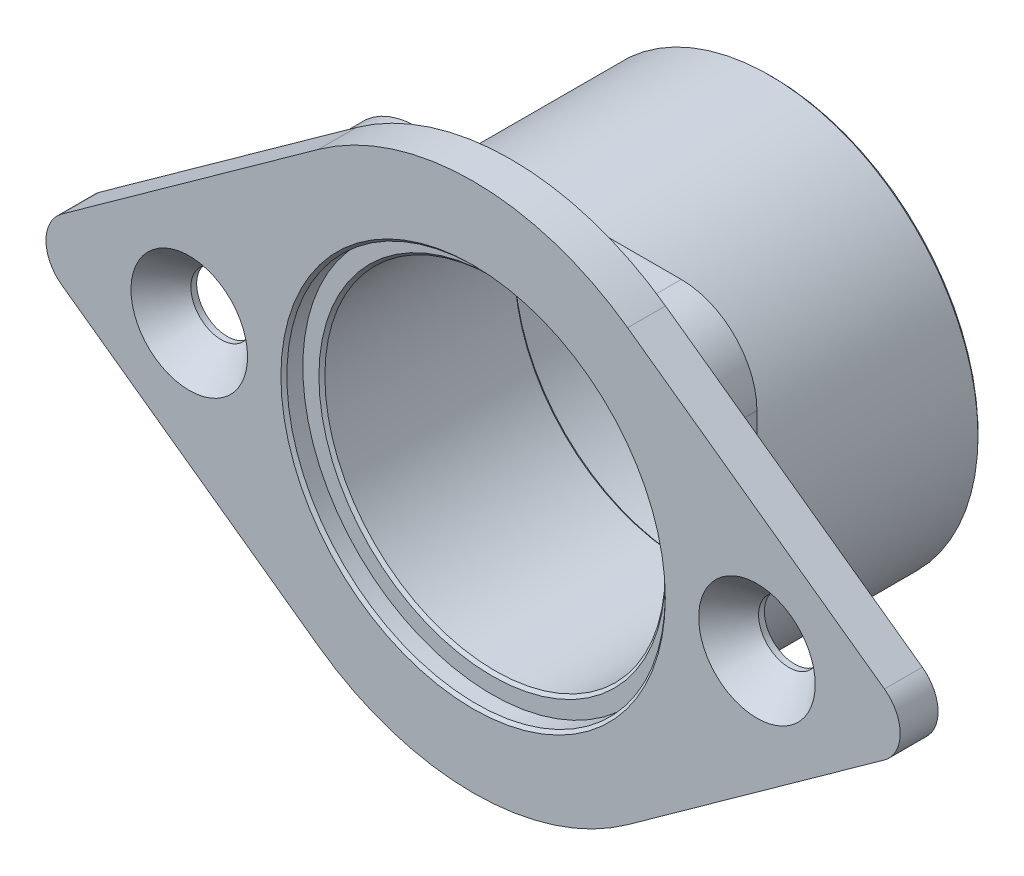
ISO-10303-21;
HEADER;
FILE_DESCRIPTION(('STEP AP214'),'2;1');
FILE_NAME('part.step','',(''),(''),'','','');
FILE_SCHEMA(('AUTOMOTIVE_DESIGN { 1 0 10303 214 1 1 1 1 }'));
ENDSEC;
DATA;
#1=APPLICATION_CONTEXT('core data for automotive mechanical design processes');
#2=APPLICATION_PROTOCOL_DEFINITION('international standard','automotive_design',2000,#1);
#3=PRODUCT_CONTEXT('',#1,'mechanical');
#4=PRODUCT('Part','Part','',(#3));
#5=PRODUCT_RELATED_PRODUCT_CATEGORY('part','',(#4));
#6=PRODUCT_DEFINITION_FORMATION('','',#4);
#7=PRODUCT_DEFINITION_CONTEXT('part definition',#1,'design');
#8=PRODUCT_DEFINITION('design','',#6,#7);
#9=PRODUCT_DEFINITION_SHAPE('','',#8);
#10=(LENGTH_UNIT() NAMED_UNIT(*) SI_UNIT(.MILLI.,.METRE.));
#11=(NAMED_UNIT(*) PLANE_ANGLE_UNIT() SI_UNIT($,.RADIAN.));
#12=(NAMED_UNIT(*) SI_UNIT($,.STERADIAN.) SOLID_ANGLE_UNIT());
#13=UNCERTAINTY_MEASURE_WITH_UNIT(LENGTH_MEASURE(1.E-05),#10,'distance_accuracy_value','');
#14=(GEOMETRIC_REPRESENTATION_CONTEXT(3) GLOBAL_UNCERTAINTY_ASSIGNED_CONTEXT((#13)) GLOBAL_UNIT_ASSIGNED_CONTEXT((#10,
#11,#12)) REPRESENTATION_CONTEXT('',''));
#15=CARTESIAN_POINT('',(0.,0.,0.));
#16=DIRECTION('',(0.,0.,1.));
#17=DIRECTION('',(1.,0.,0.));
#18=AXIS2_PLACEMENT_3D('',#15,#16,#17);
#19=CARTESIAN_POINT('',(0.,0.,0.));
#20=DIRECTION('',(0.,0.,1.));
#21=DIRECTION('',(1.,0.,0.));
#22=AXIS2_PLACEMENT_3D('',#19,#20,#21);
#23=CONICAL_SURFACE('',#22,14.5248,0.785398163397445);
#24=CARTESIAN_POINT('',(0.,0.,-0.249999999999999));
#25=DIRECTION('',(0.,0.,-1.));
#26=DIRECTION('',(-1.,0.,0.));
#27=AXIS2_PLACEMENT_3D('',#24,#25,#26);
#28=CIRCLE('',#27,14.2748);
#29=CARTESIAN_POINT('',(-14.2748,0.,-0.249999999999999));
#30=VERTEX_POINT('',#29);
#31=EDGE_CURVE('E185',#30,#30,#28,.T.);
#32=ORIENTED_EDGE('',*,*,#31,.T.);
#33=EDGE_LOOP('',(#32));
#34=FACE_BOUND('',#33,.T.);
#35=CARTESIAN_POINT('',(0.,0.,0.));
#36=DIRECTION('',(0.,0.,1.));
#37=DIRECTION('',(1.,0.,0.));
#38=AXIS2_PLACEMENT_3D('',#35,#36,#37);
#39=CIRCLE('',#38,14.5248);
#40=CARTESIAN_POINT('',(14.5248,0.,0.));
#41=VERTEX_POINT('',#40);
#42=EDGE_CURVE('E20',#41,#41,#39,.F.);
#43=ORIENTED_EDGE('',*,*,#42,.F.);
#44=EDGE_LOOP('',(#43));
#45=FACE_BOUND('',#44,.T.);
#46=ADVANCED_FACE('F17',(#34,#45),#23,.F.);
#47=CARTESIAN_POINT('',(0.,0.,0.));
#48=DIRECTION('',(0.,0.,1.));
#49=DIRECTION('',(1.,0.,0.));
#50=AXIS2_PLACEMENT_3D('',#47,#48,#49);
#51=PLANE('',#50);
#52=CARTESIAN_POINT('',(0.,0.,0.));
#53=DIRECTION('',(0.,0.,1.));
#54=DIRECTION('',(1.,0.,0.));
#55=AXIS2_PLACEMENT_3D('',#52,#53,#54);
#56=CIRCLE('',#55,15.875);
#57=CARTESIAN_POINT('',(15.875,0.,0.));
#58=VERTEX_POINT('',#57);
#59=EDGE_CURVE('E184',#58,#58,#56,.T.);
#60=ORIENTED_EDGE('',*,*,#59,.T.);
#61=EDGE_LOOP('',(#60));
#62=FACE_BOUND('',#61,.T.);
#63=ORIENTED_EDGE('',*,*,#42,.T.);
#64=EDGE_LOOP('',(#63));
#65=FACE_BOUND('',#64,.T.);
#66=ADVANCED_FACE('F279',(#62,#65),#51,.T.);
#67=CARTESIAN_POINT('',(0.,0.,1.5875));
#68=DIRECTION('',(0.,0.,-1.));
#69=DIRECTION('',(-1.,0.,0.));
#70=AXIS2_PLACEMENT_3D('',#67,#68,#69);
#71=CYLINDRICAL_SURFACE('',#70,14.2748);
#72=ORIENTED_EDGE('',*,*,#31,.F.);
#73=EDGE_LOOP('',(#72));
#74=FACE_BOUND('',#73,.T.);
#75=CARTESIAN_POINT('',(0.,0.,-16.16475));
#76=DIRECTION('',(0.,0.,-1.));
#77=DIRECTION('',(-1.,0.,0.));
#78=AXIS2_PLACEMENT_3D('',#75,#76,#77);
#79=CIRCLE('',#78,14.2748);
#80=CARTESIAN_POINT('',(-14.2748,0.,-16.16475));
#81=VERTEX_POINT('',#80);
#82=EDGE_CURVE('E181',#81,#81,#79,.T.);
#83=ORIENTED_EDGE('',*,*,#82,.T.);
#84=EDGE_LOOP('',(#83));
#85=FACE_BOUND('',#84,.T.);
#86=ADVANCED_FACE('F286',(#74,#85),#71,.F.);
#87=CARTESIAN_POINT('',(0.,0.,0.));
#88=DIRECTION('',(0.,0.,1.));
#89=DIRECTION('',(1.,0.,0.));
#90=AXIS2_PLACEMENT_3D('',#87,#88,#89);
#91=CYLINDRICAL_SURFACE('',#90,15.875);
#92=ORIENTED_EDGE('',*,*,#59,.F.);
#93=EDGE_LOOP('',(#92));
#94=FACE_BOUND('',#93,.T.);
#95=CARTESIAN_POINT('',(0.,0.,1.3375));
#96=DIRECTION('',(0.,0.,1.));
#97=DIRECTION('',(1.,0.,0.));
#98=AXIS2_PLACEMENT_3D('',#95,#96,#97);
#99=CIRCLE('',#98,15.875);
#100=CARTESIAN_POINT('',(15.875,0.,1.3375));
#101=VERTEX_POINT('',#100);
#102=EDGE_CURVE('E177',#101,#101,#99,.T.);
#103=ORIENTED_EDGE('',*,*,#102,.T.);
#104=EDGE_LOOP('',(#103));
#105=FACE_BOUND('',#104,.T.);
#106=ADVANCED_FACE('F282',(#94,#105),#91,.F.);
#107=CARTESIAN_POINT('',(0.,0.,-16.41475));
#108=DIRECTION('',(0.,0.,-1.));
#109=DIRECTION('',(-1.,0.,0.));
#110=AXIS2_PLACEMENT_3D('',#107,#108,#109);
#111=CONICAL_SURFACE('',#110,14.5248,0.785398163397452);
#112=ORIENTED_EDGE('',*,*,#82,.F.);
#113=EDGE_LOOP('',(#112));
#114=FACE_BOUND('',#113,.T.);
#115=CARTESIAN_POINT('',(0.,0.,-16.41475));
#116=DIRECTION('',(0.,0.,-1.));
#117=DIRECTION('',(-1.,0.,0.));
#118=AXIS2_PLACEMENT_3D('',#115,#116,#117);
#119=CIRCLE('',#118,14.5248);
#120=CARTESIAN_POINT('',(-14.5248,0.,-16.41475));
#121=VERTEX_POINT('',#120);
#122=EDGE_CURVE('E180',#121,#121,#119,.F.);
#123=ORIENTED_EDGE('',*,*,#122,.F.);
#124=EDGE_LOOP('',(#123));
#125=FACE_BOUND('',#124,.T.);
#126=ADVANCED_FACE('F285',(#114,#125),#111,.F.);
#127=CARTESIAN_POINT('',(0.,0.,1.5875));
#128=DIRECTION('',(0.,0.,1.));
#129=DIRECTION('',(1.,0.,0.));
#130=AXIS2_PLACEMENT_3D('',#127,#128,#129);
#131=CONICAL_SURFACE('',#130,16.125,0.785398163397434);
#132=ORIENTED_EDGE('',*,*,#102,.F.);
#133=EDGE_LOOP('',(#132));
#134=FACE_BOUND('',#133,.T.);
#135=CARTESIAN_POINT('',(0.,0.,1.5875));
#136=DIRECTION('',(0.,0.,1.));
#137=DIRECTION('',(1.,0.,0.));
#138=AXIS2_PLACEMENT_3D('',#135,#136,#137);
#139=CIRCLE('',#138,16.125);
#140=CARTESIAN_POINT('',(16.125,0.,1.5875));
#141=VERTEX_POINT('',#140);
#142=EDGE_CURVE('E272',#141,#141,#139,.F.);
#143=ORIENTED_EDGE('',*,*,#142,.F.);
#144=EDGE_LOOP('',(#143));
#145=FACE_BOUND('',#144,.T.);
#146=ADVANCED_FACE('F290',(#134,#145),#131,.F.);
#147=CARTESIAN_POINT('',(0.,0.,-16.41475));
#148=DIRECTION('',(0.,0.,-1.));
#149=DIRECTION('',(-1.,0.,0.));
#150=AXIS2_PLACEMENT_3D('',#147,#148,#149);
#151=PLANE('',#150);
#152=CARTESIAN_POINT('',(0.,0.,-16.41475));
#153=DIRECTION('',(0.,0.,-1.));
#154=DIRECTION('',(-1.,0.,0.));
#155=AXIS2_PLACEMENT_3D('',#152,#153,#154);
#156=CIRCLE('',#155,15.86865);
#157=CARTESIAN_POINT('',(-15.86865,0.,-16.41475));
#158=VERTEX_POINT('',#157);
#159=EDGE_CURVE('E176',#158,#158,#156,.T.);
#160=ORIENTED_EDGE('',*,*,#159,.T.);
#161=EDGE_LOOP('',(#160));
#162=FACE_BOUND('',#161,.T.);
#163=ORIENTED_EDGE('',*,*,#122,.T.);
#164=EDGE_LOOP('',(#163));
#165=FACE_BOUND('',#164,.T.);
#166=ADVANCED_FACE('F293',(#162,#165),#151,.T.);
#167=CARTESIAN_POINT('',(-23.8125,0.,1.58749999997099));
#168=DIRECTION('',(0.,0.,1.));
#169=DIRECTION('',(0.,-1.,0.));
#170=AXIS2_PLACEMENT_3D('',#167,#168,#169);
#171=CONICAL_SURFACE('',#170,4.88949999991382,0.715584993310947);
#172=CARTESIAN_POINT('',(-23.8125,0.,-1.10068089399405));
#173=DIRECTION('',(0.,0.,1.));
#174=DIRECTION('',(1.,0.,0.));
#175=AXIS2_PLACEMENT_3D('',#172,#173,#174);
#176=CIRCLE('',#175,2.5527);
#177=CARTESIAN_POINT('',(-21.2598,0.,-1.10068089399405));
#178=VERTEX_POINT('',#177);
#179=EDGE_CURVE('E173',#178,#178,#176,.F.);
#180=ORIENTED_EDGE('',*,*,#179,.T.);
#181=EDGE_LOOP('',(#180));
#182=FACE_BOUND('',#181,.T.);
#183=CARTESIAN_POINT('',(-23.8125,0.,1.58749999997099));
#184=DIRECTION('',(0.,0.,1.));
#185=DIRECTION('',(0.,-1.,0.));
#186=AXIS2_PLACEMENT_3D('',#183,#184,#185);
#187=CIRCLE('',#186,4.88949999991382);
#188=CARTESIAN_POINT('',(-23.8125,-4.88949999991382,1.58749999997099));
#189=VERTEX_POINT('',#188);
#190=EDGE_CURVE('E269',#189,#189,#187,.F.);
#191=ORIENTED_EDGE('',*,*,#190,.F.);
#192=EDGE_LOOP('',(#191));
#193=FACE_BOUND('',#192,.T.);
#194=ADVANCED_FACE('F309',(#182,#193),#171,.F.);
#195=CARTESIAN_POINT('',(23.8125,0.,1.58750000008467));
#196=DIRECTION('',(0.,0.,1.));
#197=DIRECTION('',(1.,0.,0.));
#198=AXIS2_PLACEMENT_3D('',#195,#196,#197);
#199=CONICAL_SURFACE('',#198,4.88950000000978,0.715584993314095);
#200=CARTESIAN_POINT('',(23.8125,0.,-1.10068089399405));
#201=DIRECTION('',(0.,0.,1.));
#202=DIRECTION('',(1.,0.,0.));
#203=AXIS2_PLACEMENT_3D('',#200,#201,#202);
#204=CIRCLE('',#203,2.5527);
#205=CARTESIAN_POINT('',(26.3652,0.,-1.10068089399405));
#206=VERTEX_POINT('',#205);
#207=EDGE_CURVE('E151',#206,#206,#204,.F.);
#208=ORIENTED_EDGE('',*,*,#207,.T.);
#209=EDGE_LOOP('',(#208));
#210=FACE_BOUND('',#209,.T.);
#211=CARTESIAN_POINT('',(23.8125,0.,1.58750000008467));
#212=DIRECTION('',(0.,0.,1.));
#213=DIRECTION('',(1.,0.,0.));
#214=AXIS2_PLACEMENT_3D('',#211,#212,#213);
#215=CIRCLE('',#214,4.88950000000978);
#216=CARTESIAN_POINT('',(28.7020000000098,0.,1.58750000008467));
#217=VERTEX_POINT('',#216);
#218=EDGE_CURVE('E266',#217,#217,#215,.F.);
#219=ORIENTED_EDGE('',*,*,#218,.F.);
#220=EDGE_LOOP('',(#219));
#221=FACE_BOUND('',#220,.T.);
#222=ADVANCED_FACE('F299',(#210,#221),#199,.F.);
#223=CARTESIAN_POINT('',(0.,0.,1.5875));
#224=DIRECTION('',(0.,0.,1.));
#225=DIRECTION('',(1.,0.,0.));
#226=AXIS2_PLACEMENT_3D('',#223,#224,#225);
#227=PLANE('',#226);
#228=DIRECTION('',(-0.812232862067414,0.583333333333333,0.));
#229=VECTOR('',#228,1.);
#230=CARTESIAN_POINT('',(-12.9645833333333,-18.0518753594483,1.5875));
#231=LINE('',#230,#229);
#232=CARTESIAN_POINT('',(-34.5092261904762,-2.57883933706404,1.5875));
#233=VERTEX_POINT('',#232);
#234=CARTESIAN_POINT('',(-12.9645833333333,-18.0518753594483,1.5875));
#235=VERTEX_POINT('',#234);
#236=EDGE_CURVE('E169',#233,#235,#231,.F.);
#237=ORIENTED_EDGE('',*,*,#236,.T.);
#238=CARTESIAN_POINT('',(0.,0.,1.5875));
#239=DIRECTION('',(0.,0.,-1.));
#240=DIRECTION('',(-1.,0.,0.));
#241=AXIS2_PLACEMENT_3D('',#238,#239,#240);
#242=CIRCLE('',#241,22.225);
#243=CARTESIAN_POINT('',(12.9645833333333,-18.0518753594483,1.5875));
#244=VERTEX_POINT('',#243);
#245=EDGE_CURVE('E258',#244,#235,#242,.T.);
#246=ORIENTED_EDGE('',*,*,#245,.F.);
#247=DIRECTION('',(0.812232862067414,0.583333333333333,0.));
#248=VECTOR('',#247,1.);
#249=CARTESIAN_POINT('',(12.9645833333333,-18.0518753594483,1.5875));
#250=LINE('',#249,#248);
#251=CARTESIAN_POINT('',(34.5092261904762,-2.57883933706403,1.5875));
#252=VERTEX_POINT('',#251);
#253=EDGE_CURVE('E687',#252,#244,#250,.F.);
#254=ORIENTED_EDGE('',*,*,#253,.F.);
#255=CARTESIAN_POINT('',(32.6571428571429,0.,1.5875));
#256=DIRECTION('',(0.,0.,-1.));
#257=DIRECTION('',(-1.,0.,0.));
#258=AXIS2_PLACEMENT_3D('',#255,#256,#257);
#259=CIRCLE('',#258,3.175);
#260=CARTESIAN_POINT('',(34.5092261904762,2.57883933706404,1.5875));
#261=VERTEX_POINT('',#260);
#262=EDGE_CURVE('E253',#261,#252,#259,.T.);
#263=ORIENTED_EDGE('',*,*,#262,.F.);
#264=DIRECTION('',(-0.812232862067414,0.583333333333333,0.));
#265=VECTOR('',#264,1.);
#266=CARTESIAN_POINT('',(12.9645833333333,18.0518753594483,1.5875));
#267=LINE('',#266,#265);
#268=CARTESIAN_POINT('',(12.9645833333333,18.0518753594483,1.5875));
#269=VERTEX_POINT('',#268);
#270=EDGE_CURVE('E147',#269,#261,#267,.F.);
#271=ORIENTED_EDGE('',*,*,#270,.F.);
#272=CARTESIAN_POINT('',(0.,0.,1.5875));
#273=DIRECTION('',(0.,0.,-1.));
#274=DIRECTION('',(-1.,0.,0.));
#275=AXIS2_PLACEMENT_3D('',#272,#273,#274);
#276=CIRCLE('',#275,22.225);
#277=CARTESIAN_POINT('',(-12.9645833333333,18.0518753594483,1.5875));
#278=VERTEX_POINT('',#277);
#279=EDGE_CURVE('E139',#278,#269,#276,.T.);
#280=ORIENTED_EDGE('',*,*,#279,.F.);
#281=DIRECTION('',(0.812232862067414,0.583333333333333,0.));
#282=VECTOR('',#281,1.);
#283=CARTESIAN_POINT('',(-12.9645833333333,18.0518753594483,1.5875));
#284=LINE('',#283,#282);
#285=CARTESIAN_POINT('',(-34.5092261904762,2.57883933706403,1.5875));
#286=VERTEX_POINT('',#285);
#287=EDGE_CURVE('E144',#278,#286,#284,.F.);
#288=ORIENTED_EDGE('',*,*,#287,.T.);
#289=CARTESIAN_POINT('',(-32.6571428571429,0.,1.5875));
#290=DIRECTION('',(0.,0.,-1.));
#291=DIRECTION('',(-1.,0.,0.));
#292=AXIS2_PLACEMENT_3D('',#289,#290,#291);
#293=CIRCLE('',#292,3.175);
#294=EDGE_CURVE('E165',#233,#286,#293,.T.);
#295=ORIENTED_EDGE('',*,*,#294,.F.);
#296=EDGE_LOOP('',(#237,#246,#254,#263,#271,#280,#288,#295));
#297=FACE_BOUND('',#296,.T.);
#298=ORIENTED_EDGE('',*,*,#218,.T.);
#299=EDGE_LOOP('',(#298));
#300=FACE_BOUND('',#299,.T.);
#301=ORIENTED_EDGE('',*,*,#190,.T.);
#302=EDGE_LOOP('',(#301));
#303=FACE_BOUND('',#302,.T.);
#304=ORIENTED_EDGE('',*,*,#142,.T.);
#305=EDGE_LOOP('',(#304));
#306=FACE_BOUND('',#305,.T.);
#307=ADVANCED_FACE('F141',(#297,#300,#303,#306),#227,.T.);
#308=CARTESIAN_POINT('',(0.,0.,-16.41475));
#309=DIRECTION('',(0.,0.,-1.));
#310=DIRECTION('',(-1.,0.,0.));
#311=AXIS2_PLACEMENT_3D('',#308,#309,#310);
#312=CYLINDRICAL_SURFACE('',#311,15.86865);
#313=ORIENTED_EDGE('',*,*,#159,.F.);
#314=EDGE_LOOP('',(#313));
#315=FACE_BOUND('',#314,.T.);
#316=CARTESIAN_POINT('',(0.,0.,-23.3085));
#317=DIRECTION('',(0.,0.,-1.));
#318=DIRECTION('',(-1.,0.,0.));
#319=AXIS2_PLACEMENT_3D('',#316,#317,#318);
#320=CIRCLE('',#319,15.86865);
#321=CARTESIAN_POINT('',(-15.86865,0.,-23.3085));
#322=VERTEX_POINT('',#321);
#323=EDGE_CURVE('E252',#322,#322,#320,.T.);
#324=ORIENTED_EDGE('',*,*,#323,.T.);
#325=EDGE_LOOP('',(#324));
#326=FACE_BOUND('',#325,.T.);
#327=ADVANCED_FACE('F298',(#315,#326),#312,.F.);
#328=CARTESIAN_POINT('',(-23.8125,0.,1.5875));
#329=DIRECTION('',(0.,0.,1.));
#330=DIRECTION('',(1.,0.,0.));
#331=AXIS2_PLACEMENT_3D('',#328,#329,#330);
#332=CYLINDRICAL_SURFACE('',#331,2.5527);
#333=CARTESIAN_POINT('',(-23.8125,0.,-1.5875));
#334=DIRECTION('',(0.,0.,1.));
#335=DIRECTION('',(1.,0.,0.));
#336=AXIS2_PLACEMENT_3D('',#333,#334,#335);
#337=CIRCLE('',#336,2.5527);
#338=CARTESIAN_POINT('',(-21.2598,0.,-1.5875));
#339=VERTEX_POINT('',#338);
#340=EDGE_CURVE('E249',#339,#339,#337,.F.);
#341=ORIENTED_EDGE('',*,*,#340,.T.);
#342=EDGE_LOOP('',(#341));
#343=FACE_BOUND('',#342,.T.);
#344=ORIENTED_EDGE('',*,*,#179,.F.);
#345=EDGE_LOOP('',(#344));
#346=FACE_BOUND('',#345,.T.);
#347=ADVANCED_FACE('F306',(#343,#346),#332,.F.);
#348=CARTESIAN_POINT('',(23.8125,0.,1.5875));
#349=DIRECTION('',(0.,0.,1.));
#350=DIRECTION('',(1.,0.,0.));
#351=AXIS2_PLACEMENT_3D('',#348,#349,#350);
#352=CYLINDRICAL_SURFACE('',#351,2.5527);
#353=CARTESIAN_POINT('',(23.8125,0.,-1.5875));
#354=DIRECTION('',(0.,0.,1.));
#355=DIRECTION('',(1.,0.,0.));
#356=AXIS2_PLACEMENT_3D('',#353,#354,#355);
#357=CIRCLE('',#356,2.5527);
#358=CARTESIAN_POINT('',(26.3652,0.,-1.5875));
#359=VERTEX_POINT('',#358);
#360=EDGE_CURVE('E246',#359,#359,#357,.F.);
#361=ORIENTED_EDGE('',*,*,#360,.T.);
#362=EDGE_LOOP('',(#361));
#363=FACE_BOUND('',#362,.T.);
#364=ORIENTED_EDGE('',*,*,#207,.F.);
#365=EDGE_LOOP('',(#364));
#366=FACE_BOUND('',#365,.T.);
#367=ADVANCED_FACE('F411',(#363,#366),#352,.F.);
#368=CARTESIAN_POINT('',(0.,0.,1.5875));
#369=DIRECTION('',(0.,0.,-1.));
#370=DIRECTION('',(-1.,0.,0.));
#371=AXIS2_PLACEMENT_3D('',#368,#369,#370);
#372=CYLINDRICAL_SURFACE('',#371,22.225);
#373=ORIENTED_EDGE('',*,*,#279,.T.);
#374=DIRECTION('',(0.,0.,1.));
#375=VECTOR('',#374,1.);
#376=CARTESIAN_POINT('',(12.9645833333333,18.0518753594483,1.5875));
#377=LINE('',#376,#375);
#378=CARTESIAN_POINT('',(12.9645833333333,18.0518753594483,-1.5875));
#379=VERTEX_POINT('',#378);
#380=EDGE_CURVE('E682',#379,#269,#377,.T.);
#381=ORIENTED_EDGE('',*,*,#380,.F.);
#382=CARTESIAN_POINT('',(0.,0.,-1.5875));
#383=DIRECTION('',(0.,0.,-1.));
#384=DIRECTION('',(-1.,0.,0.));
#385=AXIS2_PLACEMENT_3D('',#382,#383,#384);
#386=CIRCLE('',#385,22.225);
#387=CARTESIAN_POINT('',(-12.9645833333333,18.0518753594483,-1.5875));
#388=VERTEX_POINT('',#387);
#389=EDGE_CURVE('E156',#379,#388,#386,.F.);
#390=ORIENTED_EDGE('',*,*,#389,.T.);
#391=DIRECTION('',(0.,0.,1.));
#392=VECTOR('',#391,1.);
#393=CARTESIAN_POINT('',(-12.9645833333333,18.0518753594483,1.5875));
#394=LINE('',#393,#392);
#395=EDGE_CURVE('E150',#388,#278,#394,.T.);
#396=ORIENTED_EDGE('',*,*,#395,.T.);
#397=EDGE_LOOP('',(#373,#381,#390,#396));
#398=FACE_BOUND('',#397,.T.);
#399=ADVANCED_FACE('F154',(#398),#372,.T.);
#400=CARTESIAN_POINT('',(-12.9645833333333,18.0518753594483,1.5875));
#401=DIRECTION('',(0.583333333333333,-0.812232862067414,0.));
#402=DIRECTION('',(0.812232862067414,0.583333333333333,0.));
#403=AXIS2_PLACEMENT_3D('',#400,#401,#402);
#404=PLANE('',#403);
#405=DIRECTION('',(0.,0.,-1.));
#406=VECTOR('',#405,1.);
#407=CARTESIAN_POINT('',(-34.5092261904762,2.57883933706403,1.5875));
#408=LINE('',#407,#406);
#409=CARTESIAN_POINT('',(-34.5092261904762,2.57883933706403,-1.5875));
#410=VERTEX_POINT('',#409);
#411=EDGE_CURVE('E163',#286,#410,#408,.T.);
#412=ORIENTED_EDGE('',*,*,#411,.F.);
#413=ORIENTED_EDGE('',*,*,#287,.F.);
#414=ORIENTED_EDGE('',*,*,#395,.F.);
#415=DIRECTION('',(-0.812232862067414,-0.583333333333333,0.));
#416=VECTOR('',#415,1.);
#417=CARTESIAN_POINT('',(-12.9645833333333,18.0518753594483,-1.5875));
#418=LINE('',#417,#416);
#419=EDGE_CURVE('E244',#388,#410,#418,.T.);
#420=ORIENTED_EDGE('',*,*,#419,.T.);
#421=EDGE_LOOP('',(#412,#413,#414,#420));
#422=FACE_BOUND('',#421,.T.);
#423=ADVANCED_FACE('F161',(#422),#404,.F.);
#424=CARTESIAN_POINT('',(-32.6571428571429,0.,1.5875));
#425=DIRECTION('',(0.,0.,-1.));
#426=DIRECTION('',(-1.,0.,0.));
#427=AXIS2_PLACEMENT_3D('',#424,#425,#426);
#428=CYLINDRICAL_SURFACE('',#427,3.175);
#429=CARTESIAN_POINT('',(-32.6571428571429,0.,-1.5875));
#430=DIRECTION('',(0.,0.,-1.));
#431=DIRECTION('',(-1.,0.,0.));
#432=AXIS2_PLACEMENT_3D('',#429,#430,#431);
#433=CIRCLE('',#432,3.175);
#434=CARTESIAN_POINT('',(-34.5092261904762,-2.57883933706404,-1.5875));
#435=VERTEX_POINT('',#434);
#436=EDGE_CURVE('E242',#410,#435,#433,.F.);
#437=ORIENTED_EDGE('',*,*,#436,.T.);
#438=DIRECTION('',(0.,0.,1.));
#439=VECTOR('',#438,1.);
#440=CARTESIAN_POINT('',(-34.5092261904762,-2.57883933706404,1.5875));
#441=LINE('',#440,#439);
#442=EDGE_CURVE('E262',#435,#233,#441,.T.);
#443=ORIENTED_EDGE('',*,*,#442,.T.);
#444=ORIENTED_EDGE('',*,*,#294,.T.);
#445=ORIENTED_EDGE('',*,*,#411,.T.);
#446=EDGE_LOOP('',(#437,#443,#444,#445));
#447=FACE_BOUND('',#446,.T.);
#448=ADVANCED_FACE('F402',(#447),#428,.T.);
#449=CARTESIAN_POINT('',(-12.9645833333333,-18.0518753594483,1.5875));
#450=DIRECTION('',(0.583333333333333,0.812232862067414,0.));
#451=DIRECTION('',(-0.812232862067414,0.583333333333333,0.));
#452=AXIS2_PLACEMENT_3D('',#449,#450,#451);
#453=PLANE('',#452);
#454=ORIENTED_EDGE('',*,*,#442,.F.);
#455=DIRECTION('',(0.812232862067414,-0.583333333333333,0.));
#456=VECTOR('',#455,1.);
#457=CARTESIAN_POINT('',(-34.5092261904762,-2.57883933706404,-1.5875));
#458=LINE('',#457,#456);
#459=CARTESIAN_POINT('',(-12.9645833333333,-18.0518753594483,-1.5875));
#460=VERTEX_POINT('',#459);
#461=EDGE_CURVE('E241',#435,#460,#458,.T.);
#462=ORIENTED_EDGE('',*,*,#461,.T.);
#463=DIRECTION('',(0.,0.,-1.));
#464=VECTOR('',#463,1.);
#465=CARTESIAN_POINT('',(-12.9645833333333,-18.0518753594483,1.5875));
#466=LINE('',#465,#464);
#467=EDGE_CURVE('E261',#235,#460,#466,.T.);
#468=ORIENTED_EDGE('',*,*,#467,.F.);
#469=ORIENTED_EDGE('',*,*,#236,.F.);
#470=EDGE_LOOP('',(#454,#462,#468,#469));
#471=FACE_BOUND('',#470,.T.);
#472=ADVANCED_FACE('F398',(#471),#453,.F.);
#473=CARTESIAN_POINT('',(0.,0.,1.5875));
#474=DIRECTION('',(0.,0.,-1.));
#475=DIRECTION('',(-1.,0.,0.));
#476=AXIS2_PLACEMENT_3D('',#473,#474,#475);
#477=CYLINDRICAL_SURFACE('',#476,22.225);
#478=ORIENTED_EDGE('',*,*,#245,.T.);
#479=ORIENTED_EDGE('',*,*,#467,.T.);
#480=CARTESIAN_POINT('',(0.,0.,-1.5875));
#481=DIRECTION('',(0.,0.,-1.));
#482=DIRECTION('',(-1.,0.,0.));
#483=AXIS2_PLACEMENT_3D('',#480,#481,#482);
#484=CIRCLE('',#483,22.225);
#485=CARTESIAN_POINT('',(12.9645833333333,-18.0518753594483,-1.5875));
#486=VERTEX_POINT('',#485);
#487=EDGE_CURVE('E239',#460,#486,#484,.F.);
#488=ORIENTED_EDGE('',*,*,#487,.T.);
#489=DIRECTION('',(0.,0.,1.));
#490=VECTOR('',#489,1.);
#491=CARTESIAN_POINT('',(12.9645833333333,-18.0518753594483,1.5875));
#492=LINE('',#491,#490);
#493=EDGE_CURVE('E257',#244,#486,#492,.F.);
#494=ORIENTED_EDGE('',*,*,#493,.F.);
#495=EDGE_LOOP('',(#478,#479,#488,#494));
#496=FACE_BOUND('',#495,.T.);
#497=ADVANCED_FACE('F394',(#496),#477,.T.);
#498=CARTESIAN_POINT('',(12.9645833333333,-18.0518753594483,1.5875));
#499=DIRECTION('',(0.583333333333333,-0.812232862067414,0.));
#500=DIRECTION('',(0.812232862067414,0.583333333333333,0.));
#501=AXIS2_PLACEMENT_3D('',#498,#499,#500);
#502=PLANE('',#501);
#503=ORIENTED_EDGE('',*,*,#253,.T.);
#504=ORIENTED_EDGE('',*,*,#493,.T.);
#505=DIRECTION('',(0.812232862067413,0.583333333333333,0.));
#506=VECTOR('',#505,1.);
#507=CARTESIAN_POINT('',(12.9645833333333,-18.0518753594483,-1.5875));
#508=LINE('',#507,#506);
#509=CARTESIAN_POINT('',(34.5092261904762,-2.57883933706403,-1.5875));
#510=VERTEX_POINT('',#509);
#511=EDGE_CURVE('E238',#486,#510,#508,.T.);
#512=ORIENTED_EDGE('',*,*,#511,.T.);
#513=DIRECTION('',(0.,0.,-1.));
#514=VECTOR('',#513,1.);
#515=CARTESIAN_POINT('',(34.5092261904762,-2.57883933706403,1.5875));
#516=LINE('',#515,#514);
#517=EDGE_CURVE('E256',#252,#510,#516,.T.);
#518=ORIENTED_EDGE('',*,*,#517,.F.);
#519=EDGE_LOOP('',(#503,#504,#512,#518));
#520=FACE_BOUND('',#519,.T.);
#521=ADVANCED_FACE('F390',(#520),#502,.T.);
#522=CARTESIAN_POINT('',(32.6571428571429,0.,1.5875));
#523=DIRECTION('',(0.,0.,-1.));
#524=DIRECTION('',(-1.,0.,0.));
#525=AXIS2_PLACEMENT_3D('',#522,#523,#524);
#526=CYLINDRICAL_SURFACE('',#525,3.175);
#527=CARTESIAN_POINT('',(32.6571428571429,0.,-1.5875));
#528=DIRECTION('',(0.,0.,-1.));
#529=DIRECTION('',(-1.,0.,0.));
#530=AXIS2_PLACEMENT_3D('',#527,#528,#529);
#531=CIRCLE('',#530,3.175);
#532=CARTESIAN_POINT('',(34.5092261904762,2.57883933706404,-1.5875));
#533=VERTEX_POINT('',#532);
#534=EDGE_CURVE('E236',#510,#533,#531,.F.);
#535=ORIENTED_EDGE('',*,*,#534,.T.);
#536=DIRECTION('',(0.,0.,1.));
#537=VECTOR('',#536,1.);
#538=CARTESIAN_POINT('',(34.5092261904762,2.57883933706404,1.5875));
#539=LINE('',#538,#537);
#540=EDGE_CURVE('E684',#261,#533,#539,.F.);
#541=ORIENTED_EDGE('',*,*,#540,.F.);
#542=ORIENTED_EDGE('',*,*,#262,.T.);
#543=ORIENTED_EDGE('',*,*,#517,.T.);
#544=EDGE_LOOP('',(#535,#541,#542,#543));
#545=FACE_BOUND('',#544,.T.);
#546=ADVANCED_FACE('F386',(#545),#526,.T.);
#547=CARTESIAN_POINT('',(12.9645833333333,18.0518753594483,1.5875));
#548=DIRECTION('',(0.583333333333333,0.812232862067414,0.));
#549=DIRECTION('',(-0.812232862067414,0.583333333333333,0.));
#550=AXIS2_PLACEMENT_3D('',#547,#548,#549);
#551=PLANE('',#550);
#552=DIRECTION('',(-0.812232862067414,0.583333333333333,0.));
#553=VECTOR('',#552,1.);
#554=CARTESIAN_POINT('',(34.5092261904762,2.57883933706404,-1.5875));
#555=LINE('',#554,#553);
#556=EDGE_CURVE('E235',#533,#379,#555,.T.);
#557=ORIENTED_EDGE('',*,*,#556,.T.);
#558=ORIENTED_EDGE('',*,*,#380,.T.);
#559=ORIENTED_EDGE('',*,*,#270,.T.);
#560=ORIENTED_EDGE('',*,*,#540,.T.);
#561=EDGE_LOOP('',(#557,#558,#559,#560));
#562=FACE_BOUND('',#561,.T.);
#563=ADVANCED_FACE('F382',(#562),#551,.T.);
#564=CARTESIAN_POINT('',(0.,0.,-23.5585));
#565=DIRECTION('',(0.,0.,-1.));
#566=DIRECTION('',(-1.,0.,0.));
#567=AXIS2_PLACEMENT_3D('',#564,#565,#566);
#568=CONICAL_SURFACE('',#567,16.11865,0.785398163397462);
#569=ORIENTED_EDGE('',*,*,#323,.F.);
#570=EDGE_LOOP('',(#569));
#571=FACE_BOUND('',#570,.T.);
#572=CARTESIAN_POINT('',(0.,0.,-23.5585));
#573=DIRECTION('',(0.,0.,-1.));
#574=DIRECTION('',(-1.,0.,0.));
#575=AXIS2_PLACEMENT_3D('',#572,#573,#574);
#576=CIRCLE('',#575,16.11865);
#577=CARTESIAN_POINT('',(-16.11865,0.,-23.5585));
#578=VERTEX_POINT('',#577);
#579=EDGE_CURVE('E224',#578,#578,#576,.F.);
#580=ORIENTED_EDGE('',*,*,#579,.F.);
#581=EDGE_LOOP('',(#580));
#582=FACE_BOUND('',#581,.T.);
#583=ADVANCED_FACE('F378',(#571,#582),#568,.F.);
#584=CARTESIAN_POINT('',(0.,0.,-1.5875));
#585=DIRECTION('',(0.,0.,1.));
#586=DIRECTION('',(1.,0.,0.));
#587=AXIS2_PLACEMENT_3D('',#584,#585,#586);
#588=PLANE('',#587);
#589=CARTESIAN_POINT('',(-11.1125,11.1125,-1.5875));
#590=DIRECTION('',(0.,0.,1.));
#591=DIRECTION('',(1.,0.,0.));
#592=AXIS2_PLACEMENT_3D('',#589,#590,#591);
#593=CIRCLE('',#592,6.35);
#594=CARTESIAN_POINT('',(-17.4625,11.1125,-1.5875));
#595=VERTEX_POINT('',#594);
#596=CARTESIAN_POINT('',(-11.1125,17.4625,-1.5875));
#597=VERTEX_POINT('',#596);
#598=EDGE_CURVE('E220',#595,#597,#593,.F.);
#599=ORIENTED_EDGE('',*,*,#598,.F.);
#600=DIRECTION('',(0.,1.,0.));
#601=VECTOR('',#600,1.);
#602=CARTESIAN_POINT('',(-17.4625,-17.4625,-1.5875));
#603=LINE('',#602,#601);
#604=CARTESIAN_POINT('',(-17.4625,-11.1125,-1.5875));
#605=VERTEX_POINT('',#604);
#606=EDGE_CURVE('E717',#595,#605,#603,.F.);
#607=ORIENTED_EDGE('',*,*,#606,.T.);
#608=CARTESIAN_POINT('',(-11.1125,-11.1125,-1.5875));
#609=DIRECTION('',(0.,0.,1.));
#610=DIRECTION('',(1.,0.,0.));
#611=AXIS2_PLACEMENT_3D('',#608,#609,#610);
#612=CIRCLE('',#611,6.35);
#613=CARTESIAN_POINT('',(-11.1125,-17.4625,-1.5875));
#614=VERTEX_POINT('',#613);
#615=EDGE_CURVE('E228',#614,#605,#612,.F.);
#616=ORIENTED_EDGE('',*,*,#615,.F.);
#617=DIRECTION('',(1.,0.,0.));
#618=VECTOR('',#617,1.);
#619=CARTESIAN_POINT('',(17.4625,-17.4625,-1.5875));
#620=LINE('',#619,#618);
#621=CARTESIAN_POINT('',(11.1125,-17.4625,-1.5875));
#622=VERTEX_POINT('',#621);
#623=EDGE_CURVE('E720',#614,#622,#620,.T.);
#624=ORIENTED_EDGE('',*,*,#623,.T.);
#625=CARTESIAN_POINT('',(11.1125,-11.1125,-1.5875));
#626=DIRECTION('',(0.,0.,1.));
#627=DIRECTION('',(1.,0.,0.));
#628=AXIS2_PLACEMENT_3D('',#625,#626,#627);
#629=CIRCLE('',#628,6.35);
#630=CARTESIAN_POINT('',(17.4625,-11.1125,-1.5875));
#631=VERTEX_POINT('',#630);
#632=EDGE_CURVE('E232',#631,#622,#629,.F.);
#633=ORIENTED_EDGE('',*,*,#632,.F.);
#634=DIRECTION('',(0.,1.,0.));
#635=VECTOR('',#634,1.);
#636=CARTESIAN_POINT('',(17.4625,-17.4625,-1.5875));
#637=LINE('',#636,#635);
#638=CARTESIAN_POINT('',(17.4625,11.1125,-1.5875));
#639=VERTEX_POINT('',#638);
#640=EDGE_CURVE('E219',#631,#639,#637,.T.);
#641=ORIENTED_EDGE('',*,*,#640,.T.);
#642=CARTESIAN_POINT('',(11.1125,11.1125,-1.5875));
#643=DIRECTION('',(0.,0.,1.));
#644=DIRECTION('',(1.,0.,0.));
#645=AXIS2_PLACEMENT_3D('',#642,#643,#644);
#646=CIRCLE('',#645,6.35);
#647=CARTESIAN_POINT('',(11.1125,17.4625,-1.5875));
#648=VERTEX_POINT('',#647);
#649=EDGE_CURVE('E215',#648,#639,#646,.F.);
#650=ORIENTED_EDGE('',*,*,#649,.F.);
#651=DIRECTION('',(1.,0.,0.));
#652=VECTOR('',#651,1.);
#653=CARTESIAN_POINT('',(17.4625,17.4625,-1.5875));
#654=LINE('',#653,#652);
#655=EDGE_CURVE('E736',#648,#597,#654,.F.);
#656=ORIENTED_EDGE('',*,*,#655,.T.);
#657=EDGE_LOOP('',(#599,#607,#616,#624,#633,#641,#650,#656));
#658=FACE_BOUND('',#657,.T.);
#659=ORIENTED_EDGE('',*,*,#534,.F.);
#660=ORIENTED_EDGE('',*,*,#511,.F.);
#661=ORIENTED_EDGE('',*,*,#487,.F.);
#662=ORIENTED_EDGE('',*,*,#461,.F.);
#663=ORIENTED_EDGE('',*,*,#436,.F.);
#664=ORIENTED_EDGE('',*,*,#419,.F.);
#665=ORIENTED_EDGE('',*,*,#389,.F.);
#666=ORIENTED_EDGE('',*,*,#556,.F.);
#667=EDGE_LOOP('',(#659,#660,#661,#662,#663,#664,#665,#666));
#668=FACE_BOUND('',#667,.T.);
#669=ORIENTED_EDGE('',*,*,#360,.F.);
#670=EDGE_LOOP('',(#669));
#671=FACE_BOUND('',#670,.T.);
#672=ORIENTED_EDGE('',*,*,#340,.F.);
#673=EDGE_LOOP('',(#672));
#674=FACE_BOUND('',#673,.T.);
#675=ADVANCED_FACE('F374',(#658,#668,#671,#674),#588,.F.);
#676=CARTESIAN_POINT('',(11.1125,-11.1125,-4.7625));
#677=DIRECTION('',(0.,0.,1.));
#678=DIRECTION('',(1.,0.,0.));
#679=AXIS2_PLACEMENT_3D('',#676,#677,#678);
#680=CYLINDRICAL_SURFACE('',#679,6.35);
#681=ORIENTED_EDGE('',*,*,#632,.T.);
#682=DIRECTION('',(0.,0.,1.));
#683=VECTOR('',#682,1.);
#684=CARTESIAN_POINT('',(11.1125,-17.4625,-4.7625));
#685=LINE('',#684,#683);
#686=CARTESIAN_POINT('',(11.1125,-17.4625,-4.7625));
#687=VERTEX_POINT('',#686);
#688=EDGE_CURVE('E227',#622,#687,#685,.F.);
#689=ORIENTED_EDGE('',*,*,#688,.T.);
#690=CARTESIAN_POINT('',(11.1125,-11.1125,-4.7625));
#691=DIRECTION('',(0.,0.,1.));
#692=DIRECTION('',(1.,0.,0.));
#693=AXIS2_PLACEMENT_3D('',#690,#691,#692);
#694=CIRCLE('',#693,6.35);
#695=CARTESIAN_POINT('',(17.4625,-11.1125,-4.7625));
#696=VERTEX_POINT('',#695);
#697=EDGE_CURVE('E212',#687,#696,#694,.T.);
#698=ORIENTED_EDGE('',*,*,#697,.T.);
#699=DIRECTION('',(0.,0.,1.));
#700=VECTOR('',#699,1.);
#701=CARTESIAN_POINT('',(17.4625,-11.1125,-4.7625));
#702=LINE('',#701,#700);
#703=EDGE_CURVE('E716',#696,#631,#702,.T.);
#704=ORIENTED_EDGE('',*,*,#703,.T.);
#705=EDGE_LOOP('',(#681,#689,#698,#704));
#706=FACE_BOUND('',#705,.T.);
#707=ADVANCED_FACE('F370',(#706),#680,.T.);
#708=CARTESIAN_POINT('',(-11.1125,-11.1125,-4.7625));
#709=DIRECTION('',(0.,0.,1.));
#710=DIRECTION('',(1.,0.,0.));
#711=AXIS2_PLACEMENT_3D('',#708,#709,#710);
#712=CYLINDRICAL_SURFACE('',#711,6.35);
#713=ORIENTED_EDGE('',*,*,#615,.T.);
#714=DIRECTION('',(0.,0.,-1.));
#715=VECTOR('',#714,1.);
#716=CARTESIAN_POINT('',(-17.4625,-11.1125,-4.7625));
#717=LINE('',#716,#715);
#718=CARTESIAN_POINT('',(-17.4625,-11.1125,-4.7625));
#719=VERTEX_POINT('',#718);
#720=EDGE_CURVE('E719',#605,#719,#717,.T.);
#721=ORIENTED_EDGE('',*,*,#720,.T.);
#722=CARTESIAN_POINT('',(-11.1125,-11.1125,-4.7625));
#723=DIRECTION('',(0.,0.,1.));
#724=DIRECTION('',(1.,0.,0.));
#725=AXIS2_PLACEMENT_3D('',#722,#723,#724);
#726=CIRCLE('',#725,6.35);
#727=CARTESIAN_POINT('',(-11.1125,-17.4625,-4.7625));
#728=VERTEX_POINT('',#727);
#729=EDGE_CURVE('E209',#719,#728,#726,.T.);
#730=ORIENTED_EDGE('',*,*,#729,.T.);
#731=DIRECTION('',(0.,0.,1.));
#732=VECTOR('',#731,1.);
#733=CARTESIAN_POINT('',(-11.1125,-17.4625,-4.7625));
#734=LINE('',#733,#732);
#735=EDGE_CURVE('E231',#728,#614,#734,.T.);
#736=ORIENTED_EDGE('',*,*,#735,.T.);
#737=EDGE_LOOP('',(#713,#721,#730,#736));
#738=FACE_BOUND('',#737,.T.);
#739=ADVANCED_FACE('F366',(#738),#712,.T.);
#740=CARTESIAN_POINT('',(17.4625,-17.4625,-4.7625));
#741=DIRECTION('',(0.,1.,0.));
#742=DIRECTION('',(0.,0.,1.));
#743=AXIS2_PLACEMENT_3D('',#740,#741,#742);
#744=PLANE('',#743);
#745=ORIENTED_EDGE('',*,*,#688,.F.);
#746=ORIENTED_EDGE('',*,*,#623,.F.);
#747=ORIENTED_EDGE('',*,*,#735,.F.);
#748=DIRECTION('',(1.,0.,0.));
#749=VECTOR('',#748,1.);
#750=CARTESIAN_POINT('',(0.,-17.4625,-4.7625));
#751=LINE('',#750,#749);
#752=CARTESIAN_POINT('',(0.,-17.4625,-4.7625));
#753=VERTEX_POINT('',#752);
#754=EDGE_CURVE('E208',#728,#753,#751,.T.);
#755=ORIENTED_EDGE('',*,*,#754,.T.);
#756=DIRECTION('',(1.,0.,0.));
#757=VECTOR('',#756,1.);
#758=CARTESIAN_POINT('',(0.,-17.4625,-4.7625));
#759=LINE('',#758,#757);
#760=EDGE_CURVE('E214',#753,#687,#759,.T.);
#761=ORIENTED_EDGE('',*,*,#760,.T.);
#762=EDGE_LOOP('',(#745,#746,#747,#755,#761));
#763=FACE_BOUND('',#762,.T.);
#764=ADVANCED_FACE('F362',(#763),#744,.F.);
#765=CARTESIAN_POINT('',(0.,0.,-23.5585));
#766=DIRECTION('',(0.,0.,-1.));
#767=DIRECTION('',(-1.,0.,0.));
#768=AXIS2_PLACEMENT_3D('',#765,#766,#767);
#769=PLANE('',#768);
#770=ORIENTED_EDGE('',*,*,#579,.T.);
#771=EDGE_LOOP('',(#770));
#772=FACE_BOUND('',#771,.T.);
#773=CARTESIAN_POINT('',(0.,0.,-23.5585));
#774=DIRECTION('',(0.,0.,1.));
#775=DIRECTION('',(0.,-1.,0.));
#776=AXIS2_PLACEMENT_3D('',#773,#774,#775);
#777=CIRCLE('',#776,17.2125);
#778=CARTESIAN_POINT('',(0.,-17.2125,-23.5585));
#779=VERTEX_POINT('',#778);
#780=EDGE_CURVE('E205',#779,#779,#777,.T.);
#781=ORIENTED_EDGE('',*,*,#780,.F.);
#782=EDGE_LOOP('',(#781));
#783=FACE_BOUND('',#782,.T.);
#784=ADVANCED_FACE('F358',(#772,#783),#769,.T.);
#785=CARTESIAN_POINT('',(-11.1125,11.1125,-4.7625));
#786=DIRECTION('',(0.,0.,1.));
#787=DIRECTION('',(1.,0.,0.));
#788=AXIS2_PLACEMENT_3D('',#785,#786,#787);
#789=CYLINDRICAL_SURFACE('',#788,6.35);
#790=ORIENTED_EDGE('',*,*,#598,.T.);
#791=DIRECTION('',(0.,0.,-1.));
#792=VECTOR('',#791,1.);
#793=CARTESIAN_POINT('',(-11.1125,17.4625,-4.7625));
#794=LINE('',#793,#792);
#795=CARTESIAN_POINT('',(-11.1125,17.4625,-4.7625));
#796=VERTEX_POINT('',#795);
#797=EDGE_CURVE('E732',#597,#796,#794,.T.);
#798=ORIENTED_EDGE('',*,*,#797,.T.);
#799=CARTESIAN_POINT('',(-11.1125,11.1125,-4.7625));
#800=DIRECTION('',(0.,0.,1.));
#801=DIRECTION('',(1.,0.,0.));
#802=AXIS2_PLACEMENT_3D('',#799,#800,#801);
#803=CIRCLE('',#802,6.35);
#804=CARTESIAN_POINT('',(-17.4625,11.1125,-4.7625));
#805=VERTEX_POINT('',#804);
#806=EDGE_CURVE('E201',#796,#805,#803,.T.);
#807=ORIENTED_EDGE('',*,*,#806,.T.);
#808=DIRECTION('',(0.,0.,-1.));
#809=VECTOR('',#808,1.);
#810=CARTESIAN_POINT('',(-17.4625,11.1125,-4.7625));
#811=LINE('',#810,#809);
#812=EDGE_CURVE('E223',#805,#595,#811,.F.);
#813=ORIENTED_EDGE('',*,*,#812,.T.);
#814=EDGE_LOOP('',(#790,#798,#807,#813));
#815=FACE_BOUND('',#814,.T.);
#816=ADVANCED_FACE('F354',(#815),#789,.T.);
#817=CARTESIAN_POINT('',(-17.4625,-17.4625,-4.7625));
#818=DIRECTION('',(1.,0.,0.));
#819=DIRECTION('',(0.,0.,-1.));
#820=AXIS2_PLACEMENT_3D('',#817,#818,#819);
#821=PLANE('',#820);
#822=ORIENTED_EDGE('',*,*,#720,.F.);
#823=ORIENTED_EDGE('',*,*,#606,.F.);
#824=ORIENTED_EDGE('',*,*,#812,.F.);
#825=DIRECTION('',(0.,1.,0.));
#826=VECTOR('',#825,1.);
#827=CARTESIAN_POINT('',(-17.4625,0.,-4.7625));
#828=LINE('',#827,#826);
#829=CARTESIAN_POINT('',(-17.4625,0.,-4.7625));
#830=VERTEX_POINT('',#829);
#831=EDGE_CURVE('E203',#805,#830,#828,.F.);
#832=ORIENTED_EDGE('',*,*,#831,.T.);
#833=DIRECTION('',(0.,1.,0.));
#834=VECTOR('',#833,1.);
#835=CARTESIAN_POINT('',(-17.4625,0.,-4.7625));
#836=LINE('',#835,#834);
#837=EDGE_CURVE('E211',#830,#719,#836,.F.);
#838=ORIENTED_EDGE('',*,*,#837,.T.);
#839=EDGE_LOOP('',(#822,#823,#824,#832,#838));
#840=FACE_BOUND('',#839,.T.);
#841=ADVANCED_FACE('F351',(#840),#821,.F.);
#842=CARTESIAN_POINT('',(17.4625,-17.4625,-4.7625));
#843=DIRECTION('',(-1.,0.,0.));
#844=DIRECTION('',(0.,0.,1.));
#845=AXIS2_PLACEMENT_3D('',#842,#843,#844);
#846=PLANE('',#845);
#847=ORIENTED_EDGE('',*,*,#703,.F.);
#848=DIRECTION('',(0.,1.,0.));
#849=VECTOR('',#848,1.);
#850=CARTESIAN_POINT('',(17.4625,0.,-4.7625));
#851=LINE('',#850,#849);
#852=CARTESIAN_POINT('',(17.4625,0.,-4.7625));
#853=VERTEX_POINT('',#852);
#854=EDGE_CURVE('E35',#696,#853,#851,.T.);
#855=ORIENTED_EDGE('',*,*,#854,.T.);
#856=DIRECTION('',(0.,1.,0.));
#857=VECTOR('',#856,1.);
#858=CARTESIAN_POINT('',(17.4625,0.,-4.7625));
#859=LINE('',#858,#857);
#860=CARTESIAN_POINT('',(17.4625,11.1125,-4.7625));
#861=VERTEX_POINT('',#860);
#862=EDGE_CURVE('E200',#853,#861,#859,.T.);
#863=ORIENTED_EDGE('',*,*,#862,.T.);
#864=DIRECTION('',(0.,0.,1.));
#865=VECTOR('',#864,1.);
#866=CARTESIAN_POINT('',(17.4625,11.1125,-4.7625));
#867=LINE('',#866,#865);
#868=EDGE_CURVE('E218',#639,#861,#867,.F.);
#869=ORIENTED_EDGE('',*,*,#868,.F.);
#870=ORIENTED_EDGE('',*,*,#640,.F.);
#871=EDGE_LOOP('',(#847,#855,#863,#869,#870));
#872=FACE_BOUND('',#871,.T.);
#873=ADVANCED_FACE('F347',(#872),#846,.F.);
#874=CARTESIAN_POINT('',(11.1125,11.1125,-4.7625));
#875=DIRECTION('',(0.,0.,1.));
#876=DIRECTION('',(1.,0.,0.));
#877=AXIS2_PLACEMENT_3D('',#874,#875,#876);
#878=CYLINDRICAL_SURFACE('',#877,6.35);
#879=ORIENTED_EDGE('',*,*,#649,.T.);
#880=ORIENTED_EDGE('',*,*,#868,.T.);
#881=CARTESIAN_POINT('',(11.1125,11.1125,-4.7625));
#882=DIRECTION('',(0.,0.,1.));
#883=DIRECTION('',(1.,0.,0.));
#884=AXIS2_PLACEMENT_3D('',#881,#882,#883);
#885=CIRCLE('',#884,6.35);
#886=CARTESIAN_POINT('',(11.1125,17.4625,-4.7625));
#887=VERTEX_POINT('',#886);
#888=EDGE_CURVE('E198',#861,#887,#885,.T.);
#889=ORIENTED_EDGE('',*,*,#888,.T.);
#890=DIRECTION('',(0.,0.,-1.));
#891=VECTOR('',#890,1.);
#892=CARTESIAN_POINT('',(11.1125,17.4625,-4.7625));
#893=LINE('',#892,#891);
#894=EDGE_CURVE('E737',#887,#648,#893,.F.);
#895=ORIENTED_EDGE('',*,*,#894,.T.);
#896=EDGE_LOOP('',(#879,#880,#889,#895));
#897=FACE_BOUND('',#896,.T.);
#898=ADVANCED_FACE('F343',(#897),#878,.T.);
#899=CARTESIAN_POINT('',(17.4625,17.4625,-4.7625));
#900=DIRECTION('',(0.,-1.,0.));
#901=DIRECTION('',(0.,0.,-1.));
#902=AXIS2_PLACEMENT_3D('',#899,#900,#901);
#903=PLANE('',#902);
#904=ORIENTED_EDGE('',*,*,#797,.F.);
#905=ORIENTED_EDGE('',*,*,#655,.F.);
#906=ORIENTED_EDGE('',*,*,#894,.F.);
#907=DIRECTION('',(1.,0.,0.));
#908=VECTOR('',#907,1.);
#909=CARTESIAN_POINT('',(0.,17.4625,-4.7625));
#910=LINE('',#909,#908);
#911=CARTESIAN_POINT('',(0.,17.4625,-4.7625));
#912=VERTEX_POINT('',#911);
#913=EDGE_CURVE('E197',#887,#912,#910,.F.);
#914=ORIENTED_EDGE('',*,*,#913,.T.);
#915=DIRECTION('',(1.,0.,0.));
#916=VECTOR('',#915,1.);
#917=CARTESIAN_POINT('',(0.,17.4625,-4.7625));
#918=LINE('',#917,#916);
#919=EDGE_CURVE('E204',#912,#796,#918,.F.);
#920=ORIENTED_EDGE('',*,*,#919,.T.);
#921=EDGE_LOOP('',(#904,#905,#906,#914,#920));
#922=FACE_BOUND('',#921,.T.);
#923=ADVANCED_FACE('F339',(#922),#903,.F.);
#924=CARTESIAN_POINT('',(0.,0.,-4.7625));
#925=DIRECTION('',(0.,0.,1.));
#926=DIRECTION('',(1.,0.,0.));
#927=AXIS2_PLACEMENT_3D('',#924,#925,#926);
#928=PLANE('',#927);
#929=ORIENTED_EDGE('',*,*,#697,.F.);
#930=ORIENTED_EDGE('',*,*,#760,.F.);
#931=CARTESIAN_POINT('',(0.,0.,-4.7625));
#932=DIRECTION('',(0.,0.,1.));
#933=DIRECTION('',(1.,0.,0.));
#934=AXIS2_PLACEMENT_3D('',#931,#932,#933);
#935=CIRCLE('',#934,17.4625);
#936=EDGE_CURVE('E194',#853,#753,#935,.F.);
#937=ORIENTED_EDGE('',*,*,#936,.F.);
#938=ORIENTED_EDGE('',*,*,#854,.F.);
#939=EDGE_LOOP('',(#929,#930,#937,#938));
#940=FACE_BOUND('',#939,.T.);
#941=ADVANCED_FACE('F335',(#940),#928,.F.);
#942=CARTESIAN_POINT('',(0.,0.,-4.7625));
#943=DIRECTION('',(0.,0.,1.));
#944=DIRECTION('',(1.,0.,0.));
#945=AXIS2_PLACEMENT_3D('',#942,#943,#944);
#946=PLANE('',#945);
#947=ORIENTED_EDGE('',*,*,#729,.F.);
#948=ORIENTED_EDGE('',*,*,#837,.F.);
#949=CARTESIAN_POINT('',(0.,0.,-4.7625));
#950=DIRECTION('',(0.,0.,1.));
#951=DIRECTION('',(1.,0.,0.));
#952=AXIS2_PLACEMENT_3D('',#949,#950,#951);
#953=CIRCLE('',#952,17.4625);
#954=EDGE_CURVE('E191',#753,#830,#953,.F.);
#955=ORIENTED_EDGE('',*,*,#954,.F.);
#956=ORIENTED_EDGE('',*,*,#754,.F.);
#957=EDGE_LOOP('',(#947,#948,#955,#956));
#958=FACE_BOUND('',#957,.T.);
#959=ADVANCED_FACE('F331',(#958),#946,.F.);
#960=CARTESIAN_POINT('',(0.,0.,-23.3085));
#961=DIRECTION('',(0.,0.,1.));
#962=DIRECTION('',(0.,-1.,0.));
#963=AXIS2_PLACEMENT_3D('',#960,#961,#962);
#964=CONICAL_SURFACE('',#963,17.4625,0.785398163397442);
#965=CARTESIAN_POINT('',(0.,0.,-23.3085));
#966=DIRECTION('',(0.,0.,1.));
#967=DIRECTION('',(1.,0.,0.));
#968=AXIS2_PLACEMENT_3D('',#965,#966,#967);
#969=CIRCLE('',#968,17.4625);
#970=CARTESIAN_POINT('',(17.4625,0.,-23.3085));
#971=VERTEX_POINT('',#970);
#972=EDGE_CURVE('E190',#971,#971,#969,.T.);
#973=ORIENTED_EDGE('',*,*,#972,.F.);
#974=EDGE_LOOP('',(#973));
#975=FACE_BOUND('',#974,.T.);
#976=ORIENTED_EDGE('',*,*,#780,.T.);
#977=EDGE_LOOP('',(#976));
#978=FACE_BOUND('',#977,.T.);
#979=ADVANCED_FACE('F327',(#975,#978),#964,.T.);
#980=CARTESIAN_POINT('',(0.,0.,-4.7625));
#981=DIRECTION('',(0.,0.,1.));
#982=DIRECTION('',(1.,0.,0.));
#983=AXIS2_PLACEMENT_3D('',#980,#981,#982);
#984=PLANE('',#983);
#985=ORIENTED_EDGE('',*,*,#806,.F.);
#986=ORIENTED_EDGE('',*,*,#919,.F.);
#987=CARTESIAN_POINT('',(0.,0.,-4.7625));
#988=DIRECTION('',(0.,0.,1.));
#989=DIRECTION('',(1.,0.,0.));
#990=AXIS2_PLACEMENT_3D('',#987,#988,#989);
#991=CIRCLE('',#990,17.4625);
#992=EDGE_CURVE('E26',#830,#912,#991,.F.);
#993=ORIENTED_EDGE('',*,*,#992,.F.);
#994=ORIENTED_EDGE('',*,*,#831,.F.);
#995=EDGE_LOOP('',(#985,#986,#993,#994));
#996=FACE_BOUND('',#995,.T.);
#997=ADVANCED_FACE('F320',(#996),#984,.F.);
#998=CARTESIAN_POINT('',(0.,0.,-4.7625));
#999=DIRECTION('',(0.,0.,1.));
#1000=DIRECTION('',(1.,0.,0.));
#1001=AXIS2_PLACEMENT_3D('',#998,#999,#1000);
#1002=PLANE('',#1001);
#1003=ORIENTED_EDGE('',*,*,#888,.F.);
#1004=ORIENTED_EDGE('',*,*,#862,.F.);
#1005=CARTESIAN_POINT('',(0.,0.,-4.7625));
#1006=DIRECTION('',(0.,0.,1.));
#1007=DIRECTION('',(1.,0.,0.));
#1008=AXIS2_PLACEMENT_3D('',#1005,#1006,#1007);
#1009=CIRCLE('',#1008,17.4625);
#1010=EDGE_CURVE('E11',#912,#853,#1009,.F.);
#1011=ORIENTED_EDGE('',*,*,#1010,.F.);
#1012=ORIENTED_EDGE('',*,*,#913,.F.);
#1013=EDGE_LOOP('',(#1003,#1004,#1011,#1012));
#1014=FACE_BOUND('',#1013,.T.);
#1015=ADVANCED_FACE('F314',(#1014),#1002,.F.);
#1016=CARTESIAN_POINT('',(0.,0.,-23.5585));
#1017=DIRECTION('',(0.,0.,1.));
#1018=DIRECTION('',(1.,0.,0.));
#1019=AXIS2_PLACEMENT_3D('',#1016,#1017,#1018);
#1020=CYLINDRICAL_SURFACE('',#1019,17.4625);
#1021=ORIENTED_EDGE('',*,*,#954,.T.);
#1022=ORIENTED_EDGE('',*,*,#992,.T.);
#1023=ORIENTED_EDGE('',*,*,#1010,.T.);
#1024=ORIENTED_EDGE('',*,*,#936,.T.);
#1025=EDGE_LOOP('',(#1021,#1022,#1023,#1024));
#1026=FACE_BOUND('',#1025,.T.);
#1027=ORIENTED_EDGE('',*,*,#972,.T.);
#1028=EDGE_LOOP('',(#1027));
#1029=FACE_BOUND('',#1028,.T.);
#1030=ADVANCED_FACE('F312',(#1026,#1029),#1020,.T.);
#1031=CLOSED_SHELL('',(#46,#66,#86,#106,#126,#146,#166,#194,#222,#307,#327,#347,#367,#399,#423,
#448,#472,#497,#521,#546,#563,#583,#675,#707,#739,#764,#784,#816,#841,#873,#898,#923,#941,#959,
#979,#997,#1015,#1030));
#1032=MANIFOLD_SOLID_BREP('B1',#1031);
#1033=ADVANCED_BREP_SHAPE_REPRESENTATION('',(#18,#1032),#14);
#1034=SHAPE_DEFINITION_REPRESENTATION(#9,#1033);
ENDSEC;
END-ISO-10303-21;
